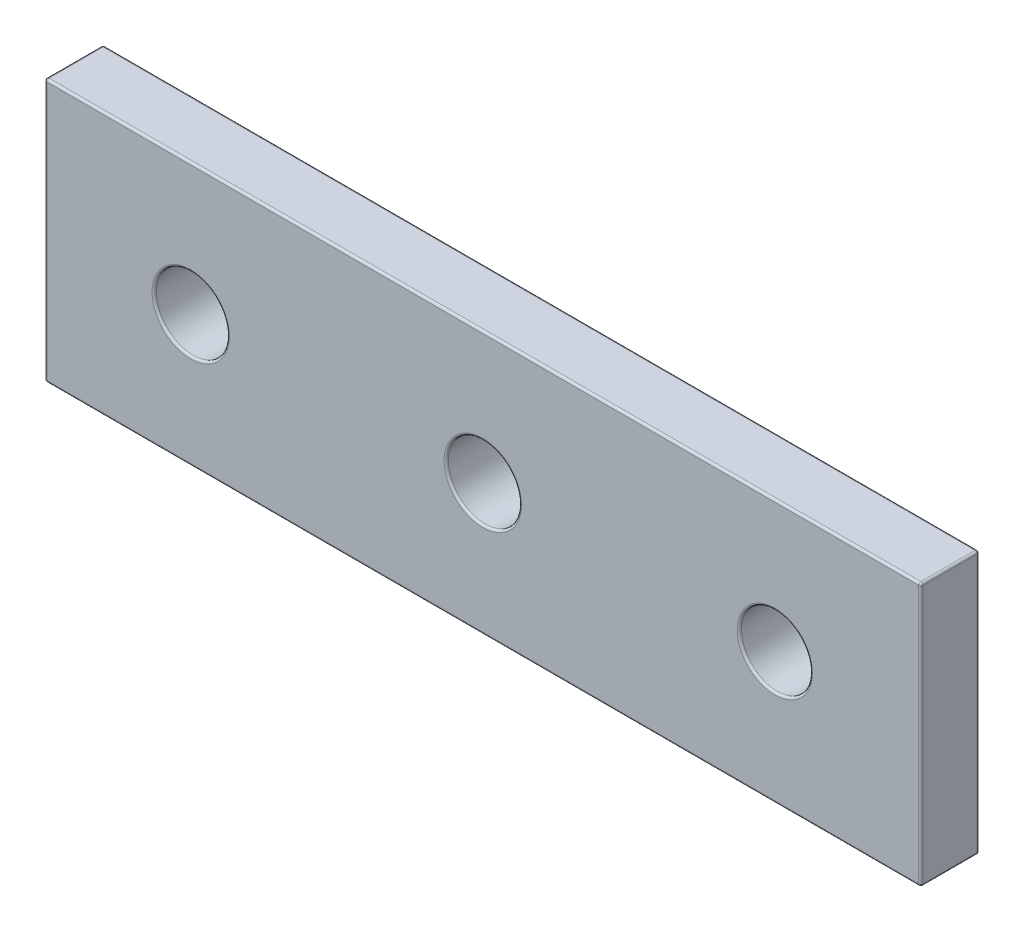
ISO-10303-21;
HEADER;
FILE_DESCRIPTION(('STEP AP214'),'2;1');
FILE_NAME('part.step','',(''),(''),'','','');
FILE_SCHEMA(('AUTOMOTIVE_DESIGN { 1 0 10303 214 1 1 1 1 }'));
ENDSEC;
DATA;
#1=APPLICATION_CONTEXT('core data for automotive mechanical design processes');
#2=APPLICATION_PROTOCOL_DEFINITION('international standard','automotive_design',2000,#1);
#3=PRODUCT_CONTEXT('',#1,'mechanical');
#4=PRODUCT('Part','Part','',(#3));
#5=PRODUCT_RELATED_PRODUCT_CATEGORY('part','',(#4));
#6=PRODUCT_DEFINITION_FORMATION('','',#4);
#7=PRODUCT_DEFINITION_CONTEXT('part definition',#1,'design');
#8=PRODUCT_DEFINITION('design','',#6,#7);
#9=PRODUCT_DEFINITION_SHAPE('','',#8);
#10=(LENGTH_UNIT() NAMED_UNIT(*) SI_UNIT(.MILLI.,.METRE.));
#11=(NAMED_UNIT(*) PLANE_ANGLE_UNIT() SI_UNIT($,.RADIAN.));
#12=(NAMED_UNIT(*) SI_UNIT($,.STERADIAN.) SOLID_ANGLE_UNIT());
#13=UNCERTAINTY_MEASURE_WITH_UNIT(LENGTH_MEASURE(1.E-05),#10,'distance_accuracy_value','');
#14=(GEOMETRIC_REPRESENTATION_CONTEXT(3) GLOBAL_UNCERTAINTY_ASSIGNED_CONTEXT((#13)) GLOBAL_UNIT_ASSIGNED_CONTEXT((#10,
#11,#12)) REPRESENTATION_CONTEXT('',''));
#15=CARTESIAN_POINT('',(0.,0.,0.));
#16=DIRECTION('',(0.,0.,1.));
#17=DIRECTION('',(1.,0.,0.));
#18=AXIS2_PLACEMENT_3D('',#15,#16,#17);
#19=CARTESIAN_POINT('',(0.,0.,4.));
#20=DIRECTION('',(0.,0.,1.));
#21=DIRECTION('',(1.,0.,0.));
#22=AXIS2_PLACEMENT_3D('',#19,#20,#21);
#23=PLANE('',#22);
#24=CARTESIAN_POINT('',(20.,0.,4.));
#25=DIRECTION('',(0.,0.,1.));
#26=DIRECTION('',(1.,0.,0.));
#27=AXIS2_PLACEMENT_3D('',#24,#25,#26);
#28=CIRCLE('',#27,2.5758241682766);
#29=CARTESIAN_POINT('',(22.5758241682766,0.,4.));
#30=VERTEX_POINT('',#29);
#31=EDGE_CURVE('E12',#30,#30,#28,.F.);
#32=ORIENTED_EDGE('',*,*,#31,.T.);
#33=EDGE_LOOP('',(#32));
#34=FACE_BOUND('',#33,.T.);
#35=CARTESIAN_POINT('',(0.,0.,4.));
#36=DIRECTION('',(0.,0.,1.));
#37=DIRECTION('',(1.,0.,0.));
#38=AXIS2_PLACEMENT_3D('',#35,#36,#37);
#39=CIRCLE('',#38,2.65);
#40=CARTESIAN_POINT('',(2.65,0.,4.));
#41=VERTEX_POINT('',#40);
#42=EDGE_CURVE('E86',#41,#41,#39,.F.);
#43=ORIENTED_EDGE('',*,*,#42,.T.);
#44=EDGE_LOOP('',(#43));
#45=FACE_BOUND('',#44,.T.);
#46=DIRECTION('',(0.,-1.,0.));
#47=VECTOR('',#46,1.);
#48=CARTESIAN_POINT('',(29.85,0.,4.));
#49=LINE('',#48,#47);
#50=CARTESIAN_POINT('',(29.85,-8.85,4.));
#51=VERTEX_POINT('',#50);
#52=CARTESIAN_POINT('',(29.85,8.85,4.));
#53=VERTEX_POINT('',#52);
#54=EDGE_CURVE('E94',#51,#53,#49,.F.);
#55=ORIENTED_EDGE('',*,*,#54,.T.);
#56=DIRECTION('',(1.,0.,0.));
#57=VECTOR('',#56,1.);
#58=CARTESIAN_POINT('',(0.,8.85,4.));
#59=LINE('',#58,#57);
#60=CARTESIAN_POINT('',(-29.85,8.85,4.));
#61=VERTEX_POINT('',#60);
#62=EDGE_CURVE('E275',#53,#61,#59,.F.);
#63=ORIENTED_EDGE('',*,*,#62,.T.);
#64=DIRECTION('',(0.,-1.,0.));
#65=VECTOR('',#64,1.);
#66=CARTESIAN_POINT('',(-29.85,-9.,4.));
#67=LINE('',#66,#65);
#68=CARTESIAN_POINT('',(-29.85,-8.85,4.));
#69=VERTEX_POINT('',#68);
#70=EDGE_CURVE('E271',#61,#69,#67,.T.);
#71=ORIENTED_EDGE('',*,*,#70,.T.);
#72=DIRECTION('',(1.,0.,0.));
#73=VECTOR('',#72,1.);
#74=CARTESIAN_POINT('',(30.,-8.85,4.));
#75=LINE('',#74,#73);
#76=EDGE_CURVE('E99',#69,#51,#75,.T.);
#77=ORIENTED_EDGE('',*,*,#76,.T.);
#78=EDGE_LOOP('',(#55,#63,#71,#77));
#79=FACE_BOUND('',#78,.T.);
#80=CARTESIAN_POINT('',(-20.,0.,4.));
#81=DIRECTION('',(0.,0.,1.));
#82=DIRECTION('',(1.,0.,0.));
#83=AXIS2_PLACEMENT_3D('',#80,#81,#82);
#84=CIRCLE('',#83,2.65);
#85=CARTESIAN_POINT('',(-17.35,0.,4.));
#86=VERTEX_POINT('',#85);
#87=EDGE_CURVE('E268',#86,#86,#84,.F.);
#88=ORIENTED_EDGE('',*,*,#87,.T.);
#89=EDGE_LOOP('',(#88));
#90=FACE_BOUND('',#89,.T.);
#91=ADVANCED_FACE('F77',(#34,#45,#79,#90),#23,.T.);
#92=CARTESIAN_POINT('',(0.,0.,0.));
#93=DIRECTION('',(0.,0.,1.));
#94=DIRECTION('',(1.,0.,0.));
#95=AXIS2_PLACEMENT_3D('',#92,#93,#94);
#96=PLANE('',#95);
#97=CARTESIAN_POINT('',(20.,0.,0.));
#98=DIRECTION('',(0.,0.,1.));
#99=DIRECTION('',(1.,0.,0.));
#100=AXIS2_PLACEMENT_3D('',#97,#98,#99);
#101=CIRCLE('',#100,2.5758241682766);
#102=CARTESIAN_POINT('',(22.5758241682766,0.,0.));
#103=VERTEX_POINT('',#102);
#104=EDGE_CURVE('E209',#103,#103,#101,.T.);
#105=ORIENTED_EDGE('',*,*,#104,.T.);
#106=EDGE_LOOP('',(#105));
#107=FACE_BOUND('',#106,.T.);
#108=CARTESIAN_POINT('',(0.,0.,0.));
#109=DIRECTION('',(0.,0.,1.));
#110=DIRECTION('',(1.,0.,0.));
#111=AXIS2_PLACEMENT_3D('',#108,#109,#110);
#112=CIRCLE('',#111,2.65);
#113=CARTESIAN_POINT('',(2.65,0.,0.));
#114=VERTEX_POINT('',#113);
#115=EDGE_CURVE('E206',#114,#114,#112,.T.);
#116=ORIENTED_EDGE('',*,*,#115,.T.);
#117=EDGE_LOOP('',(#116));
#118=FACE_BOUND('',#117,.T.);
#119=DIRECTION('',(0.,-1.,0.));
#120=VECTOR('',#119,1.);
#121=CARTESIAN_POINT('',(29.85,-9.,0.));
#122=LINE('',#121,#120);
#123=CARTESIAN_POINT('',(29.85,8.85,0.));
#124=VERTEX_POINT('',#123);
#125=CARTESIAN_POINT('',(29.85,-8.85,0.));
#126=VERTEX_POINT('',#125);
#127=EDGE_CURVE('E204',#124,#126,#122,.T.);
#128=ORIENTED_EDGE('',*,*,#127,.T.);
#129=DIRECTION('',(1.,0.,0.));
#130=VECTOR('',#129,1.);
#131=CARTESIAN_POINT('',(0.,-8.85,0.));
#132=LINE('',#131,#130);
#133=CARTESIAN_POINT('',(-29.85,-8.85,0.));
#134=VERTEX_POINT('',#133);
#135=EDGE_CURVE('E172',#126,#134,#132,.F.);
#136=ORIENTED_EDGE('',*,*,#135,.T.);
#137=DIRECTION('',(0.,-1.,0.));
#138=VECTOR('',#137,1.);
#139=CARTESIAN_POINT('',(-29.85,0.,0.));
#140=LINE('',#139,#138);
#141=CARTESIAN_POINT('',(-29.85,8.85,0.));
#142=VERTEX_POINT('',#141);
#143=EDGE_CURVE('E192',#134,#142,#140,.F.);
#144=ORIENTED_EDGE('',*,*,#143,.T.);
#145=DIRECTION('',(1.,0.,0.));
#146=VECTOR('',#145,1.);
#147=CARTESIAN_POINT('',(30.,8.85,0.));
#148=LINE('',#147,#146);
#149=EDGE_CURVE('E198',#142,#124,#148,.T.);
#150=ORIENTED_EDGE('',*,*,#149,.T.);
#151=EDGE_LOOP('',(#128,#136,#144,#150));
#152=FACE_BOUND('',#151,.T.);
#153=CARTESIAN_POINT('',(-20.,0.,0.));
#154=DIRECTION('',(0.,0.,1.));
#155=DIRECTION('',(1.,0.,0.));
#156=AXIS2_PLACEMENT_3D('',#153,#154,#155);
#157=CIRCLE('',#156,2.65);
#158=CARTESIAN_POINT('',(-17.35,0.,0.));
#159=VERTEX_POINT('',#158);
#160=EDGE_CURVE('E199',#159,#159,#157,.T.);
#161=ORIENTED_EDGE('',*,*,#160,.T.);
#162=EDGE_LOOP('',(#161));
#163=FACE_BOUND('',#162,.T.);
#164=ADVANCED_FACE('F201',(#107,#118,#152,#163),#96,.F.);
#165=CARTESIAN_POINT('',(-30.,9.,4.));
#166=DIRECTION('',(1.,0.,0.));
#167=DIRECTION('',(0.,0.,-1.));
#168=AXIS2_PLACEMENT_3D('',#165,#166,#167);
#169=PLANE('',#168);
#170=DIRECTION('',(0.,-1.,0.));
#171=VECTOR('',#170,1.);
#172=CARTESIAN_POINT('',(-30.,9.,3.85));
#173=LINE('',#172,#171);
#174=CARTESIAN_POINT('',(-30.,-8.85,3.85));
#175=VERTEX_POINT('',#174);
#176=CARTESIAN_POINT('',(-30.,8.85,3.85));
#177=VERTEX_POINT('',#176);
#178=EDGE_CURVE('E255',#175,#177,#173,.F.);
#179=ORIENTED_EDGE('',*,*,#178,.T.);
#180=DIRECTION('',(0.,0.,-1.));
#181=VECTOR('',#180,1.);
#182=CARTESIAN_POINT('',(-30.,8.85,0.));
#183=LINE('',#182,#181);
#184=CARTESIAN_POINT('',(-30.,8.85,0.15));
#185=VERTEX_POINT('',#184);
#186=EDGE_CURVE('E260',#177,#185,#183,.T.);
#187=ORIENTED_EDGE('',*,*,#186,.T.);
#188=DIRECTION('',(0.,-1.,0.));
#189=VECTOR('',#188,1.);
#190=CARTESIAN_POINT('',(-30.,9.,0.15));
#191=LINE('',#190,#189);
#192=CARTESIAN_POINT('',(-30.,-8.85,0.15));
#193=VERTEX_POINT('',#192);
#194=EDGE_CURVE('E257',#185,#193,#191,.T.);
#195=ORIENTED_EDGE('',*,*,#194,.T.);
#196=DIRECTION('',(0.,0.,-1.));
#197=VECTOR('',#196,1.);
#198=CARTESIAN_POINT('',(-30.,-8.85,4.));
#199=LINE('',#198,#197);
#200=EDGE_CURVE('E253',#193,#175,#199,.F.);
#201=ORIENTED_EDGE('',*,*,#200,.T.);
#202=EDGE_LOOP('',(#179,#187,#195,#201));
#203=FACE_BOUND('',#202,.T.);
#204=ADVANCED_FACE('F373',(#203),#169,.F.);
#205=CARTESIAN_POINT('',(-30.,-9.,4.));
#206=DIRECTION('',(0.,1.,0.));
#207=DIRECTION('',(0.,0.,1.));
#208=AXIS2_PLACEMENT_3D('',#205,#206,#207);
#209=PLANE('',#208);
#210=DIRECTION('',(1.,0.,0.));
#211=VECTOR('',#210,1.);
#212=CARTESIAN_POINT('',(-30.,-9.,3.85));
#213=LINE('',#212,#211);
#214=CARTESIAN_POINT('',(29.85,-9.,3.85));
#215=VERTEX_POINT('',#214);
#216=CARTESIAN_POINT('',(-29.85,-9.,3.85));
#217=VERTEX_POINT('',#216);
#218=EDGE_CURVE('E230',#215,#217,#213,.F.);
#219=ORIENTED_EDGE('',*,*,#218,.T.);
#220=DIRECTION('',(0.,0.,-1.));
#221=VECTOR('',#220,1.);
#222=CARTESIAN_POINT('',(-29.85,-9.,4.));
#223=LINE('',#222,#221);
#224=CARTESIAN_POINT('',(-29.85,-9.,0.15));
#225=VERTEX_POINT('',#224);
#226=EDGE_CURVE('E233',#217,#225,#223,.T.);
#227=ORIENTED_EDGE('',*,*,#226,.T.);
#228=DIRECTION('',(1.,0.,0.));
#229=VECTOR('',#228,1.);
#230=CARTESIAN_POINT('',(-30.,-9.,0.15));
#231=LINE('',#230,#229);
#232=CARTESIAN_POINT('',(29.85,-9.,0.15));
#233=VERTEX_POINT('',#232);
#234=EDGE_CURVE('E175',#225,#233,#231,.T.);
#235=ORIENTED_EDGE('',*,*,#234,.T.);
#236=DIRECTION('',(0.,0.,-1.));
#237=VECTOR('',#236,1.);
#238=CARTESIAN_POINT('',(29.85,-9.,4.));
#239=LINE('',#238,#237);
#240=EDGE_CURVE('E228',#233,#215,#239,.F.);
#241=ORIENTED_EDGE('',*,*,#240,.T.);
#242=EDGE_LOOP('',(#219,#227,#235,#241));
#243=FACE_BOUND('',#242,.T.);
#244=ADVANCED_FACE('F365',(#243),#209,.F.);
#245=CARTESIAN_POINT('',(30.,9.,4.));
#246=DIRECTION('',(1.,0.,0.));
#247=DIRECTION('',(0.,0.,-1.));
#248=AXIS2_PLACEMENT_3D('',#245,#246,#247);
#249=PLANE('',#248);
#250=DIRECTION('',(0.,-1.,0.));
#251=VECTOR('',#250,1.);
#252=CARTESIAN_POINT('',(30.,9.,3.85));
#253=LINE('',#252,#251);
#254=CARTESIAN_POINT('',(30.,8.85,3.85));
#255=VERTEX_POINT('',#254);
#256=CARTESIAN_POINT('',(30.,-8.85,3.85));
#257=VERTEX_POINT('',#256);
#258=EDGE_CURVE('E237',#255,#257,#253,.T.);
#259=ORIENTED_EDGE('',*,*,#258,.T.);
#260=DIRECTION('',(0.,0.,-1.));
#261=VECTOR('',#260,1.);
#262=CARTESIAN_POINT('',(30.,-8.85,0.));
#263=LINE('',#262,#261);
#264=CARTESIAN_POINT('',(30.,-8.85,0.15));
#265=VERTEX_POINT('',#264);
#266=EDGE_CURVE('E242',#257,#265,#263,.T.);
#267=ORIENTED_EDGE('',*,*,#266,.T.);
#268=DIRECTION('',(0.,-1.,0.));
#269=VECTOR('',#268,1.);
#270=CARTESIAN_POINT('',(30.,9.,0.15));
#271=LINE('',#270,#269);
#272=CARTESIAN_POINT('',(30.,8.85,0.15));
#273=VERTEX_POINT('',#272);
#274=EDGE_CURVE('E239',#265,#273,#271,.F.);
#275=ORIENTED_EDGE('',*,*,#274,.T.);
#276=DIRECTION('',(0.,0.,-1.));
#277=VECTOR('',#276,1.);
#278=CARTESIAN_POINT('',(30.,8.85,4.));
#279=LINE('',#278,#277);
#280=EDGE_CURVE('E235',#273,#255,#279,.F.);
#281=ORIENTED_EDGE('',*,*,#280,.T.);
#282=EDGE_LOOP('',(#259,#267,#275,#281));
#283=FACE_BOUND('',#282,.T.);
#284=ADVANCED_FACE('F409',(#283),#249,.T.);
#285=CARTESIAN_POINT('',(-30.,9.,4.));
#286=DIRECTION('',(0.,1.,0.));
#287=DIRECTION('',(0.,0.,1.));
#288=AXIS2_PLACEMENT_3D('',#285,#286,#287);
#289=PLANE('',#288);
#290=DIRECTION('',(1.,0.,0.));
#291=VECTOR('',#290,1.);
#292=CARTESIAN_POINT('',(-30.,9.,0.15));
#293=LINE('',#292,#291);
#294=CARTESIAN_POINT('',(29.85,9.,0.15));
#295=VERTEX_POINT('',#294);
#296=CARTESIAN_POINT('',(-29.85,9.,0.15));
#297=VERTEX_POINT('',#296);
#298=EDGE_CURVE('E248',#295,#297,#293,.F.);
#299=ORIENTED_EDGE('',*,*,#298,.T.);
#300=DIRECTION('',(0.,0.,-1.));
#301=VECTOR('',#300,1.);
#302=CARTESIAN_POINT('',(-29.85,9.,4.));
#303=LINE('',#302,#301);
#304=CARTESIAN_POINT('',(-29.85,9.,3.85));
#305=VERTEX_POINT('',#304);
#306=EDGE_CURVE('E251',#297,#305,#303,.F.);
#307=ORIENTED_EDGE('',*,*,#306,.T.);
#308=DIRECTION('',(1.,0.,0.));
#309=VECTOR('',#308,1.);
#310=CARTESIAN_POINT('',(-30.,9.,3.85));
#311=LINE('',#310,#309);
#312=CARTESIAN_POINT('',(29.85,9.,3.85));
#313=VERTEX_POINT('',#312);
#314=EDGE_CURVE('E246',#305,#313,#311,.T.);
#315=ORIENTED_EDGE('',*,*,#314,.T.);
#316=DIRECTION('',(0.,0.,-1.));
#317=VECTOR('',#316,1.);
#318=CARTESIAN_POINT('',(29.85,9.,4.));
#319=LINE('',#318,#317);
#320=EDGE_CURVE('E244',#313,#295,#319,.T.);
#321=ORIENTED_EDGE('',*,*,#320,.T.);
#322=EDGE_LOOP('',(#299,#307,#315,#321));
#323=FACE_BOUND('',#322,.T.);
#324=ADVANCED_FACE('F406',(#323),#289,.T.);
#325=CARTESIAN_POINT('',(0.,0.,4.));
#326=DIRECTION('',(0.,0.,-1.));
#327=DIRECTION('',(-1.,0.,0.));
#328=AXIS2_PLACEMENT_3D('',#325,#326,#327);
#329=CYLINDRICAL_SURFACE('',#328,2.5);
#330=CARTESIAN_POINT('',(0.,0.,0.15));
#331=DIRECTION('',(0.,0.,1.));
#332=DIRECTION('',(1.,0.,0.));
#333=AXIS2_PLACEMENT_3D('',#330,#331,#332);
#334=CIRCLE('',#333,2.5);
#335=CARTESIAN_POINT('',(2.5,0.,0.15));
#336=VERTEX_POINT('',#335);
#337=EDGE_CURVE('E225',#336,#336,#334,.F.);
#338=ORIENTED_EDGE('',*,*,#337,.T.);
#339=EDGE_LOOP('',(#338));
#340=FACE_BOUND('',#339,.T.);
#341=CARTESIAN_POINT('',(0.,0.,3.85));
#342=DIRECTION('',(0.,0.,1.));
#343=DIRECTION('',(1.,0.,0.));
#344=AXIS2_PLACEMENT_3D('',#341,#342,#343);
#345=CIRCLE('',#344,2.5);
#346=CARTESIAN_POINT('',(2.5,0.,3.85));
#347=VERTEX_POINT('',#346);
#348=EDGE_CURVE('E222',#347,#347,#345,.T.);
#349=ORIENTED_EDGE('',*,*,#348,.T.);
#350=EDGE_LOOP('',(#349));
#351=FACE_BOUND('',#350,.T.);
#352=ADVANCED_FACE('F403',(#340,#351),#329,.F.);
#353=CARTESIAN_POINT('',(-20.,0.,4.));
#354=DIRECTION('',(0.,0.,-1.));
#355=DIRECTION('',(-1.,0.,0.));
#356=AXIS2_PLACEMENT_3D('',#353,#354,#355);
#357=CYLINDRICAL_SURFACE('',#356,2.5);
#358=CARTESIAN_POINT('',(-20.,0.,0.15));
#359=DIRECTION('',(0.,0.,1.));
#360=DIRECTION('',(1.,0.,0.));
#361=AXIS2_PLACEMENT_3D('',#358,#359,#360);
#362=CIRCLE('',#361,2.5);
#363=CARTESIAN_POINT('',(-17.5,0.,0.15));
#364=VERTEX_POINT('',#363);
#365=EDGE_CURVE('E265',#364,#364,#362,.F.);
#366=ORIENTED_EDGE('',*,*,#365,.T.);
#367=EDGE_LOOP('',(#366));
#368=FACE_BOUND('',#367,.T.);
#369=CARTESIAN_POINT('',(-20.,0.,3.85));
#370=DIRECTION('',(0.,0.,1.));
#371=DIRECTION('',(1.,0.,0.));
#372=AXIS2_PLACEMENT_3D('',#369,#370,#371);
#373=CIRCLE('',#372,2.5);
#374=CARTESIAN_POINT('',(-17.5,0.,3.85));
#375=VERTEX_POINT('',#374);
#376=EDGE_CURVE('E262',#375,#375,#373,.T.);
#377=ORIENTED_EDGE('',*,*,#376,.T.);
#378=EDGE_LOOP('',(#377));
#379=FACE_BOUND('',#378,.T.);
#380=ADVANCED_FACE('F490',(#368,#379),#357,.F.);
#381=CARTESIAN_POINT('',(20.,0.,4.));
#382=DIRECTION('',(0.,0.,-1.));
#383=DIRECTION('',(-1.,0.,0.));
#384=AXIS2_PLACEMENT_3D('',#381,#382,#383);
#385=CYLINDRICAL_SURFACE('',#384,2.4258241682766);
#386=CARTESIAN_POINT('',(20.,0.,0.15));
#387=DIRECTION('',(0.,0.,1.));
#388=DIRECTION('',(1.,0.,0.));
#389=AXIS2_PLACEMENT_3D('',#386,#387,#388);
#390=CIRCLE('',#389,2.4258241682766);
#391=CARTESIAN_POINT('',(22.4258241682766,0.,0.15));
#392=VERTEX_POINT('',#391);
#393=EDGE_CURVE('E219',#392,#392,#390,.F.);
#394=ORIENTED_EDGE('',*,*,#393,.T.);
#395=EDGE_LOOP('',(#394));
#396=FACE_BOUND('',#395,.T.);
#397=CARTESIAN_POINT('',(20.,0.,3.85));
#398=DIRECTION('',(0.,0.,1.));
#399=DIRECTION('',(1.,0.,0.));
#400=AXIS2_PLACEMENT_3D('',#397,#398,#399);
#401=CIRCLE('',#400,2.4258241682766);
#402=CARTESIAN_POINT('',(22.4258241682766,0.,3.85));
#403=VERTEX_POINT('',#402);
#404=EDGE_CURVE('E216',#403,#403,#401,.T.);
#405=ORIENTED_EDGE('',*,*,#404,.T.);
#406=EDGE_LOOP('',(#405));
#407=FACE_BOUND('',#406,.T.);
#408=ADVANCED_FACE('F422',(#396,#407),#385,.F.);
#409=CARTESIAN_POINT('',(20.,0.,0.15));
#410=DIRECTION('',(0.,0.,1.));
#411=DIRECTION('',(1.,0.,0.));
#412=AXIS2_PLACEMENT_3D('',#409,#410,#411);
#413=TOROIDAL_SURFACE('',#412,2.5758241682766,0.15);
#414=ORIENTED_EDGE('',*,*,#393,.F.);
#415=EDGE_LOOP('',(#414));
#416=FACE_BOUND('',#415,.T.);
#417=ORIENTED_EDGE('',*,*,#104,.F.);
#418=EDGE_LOOP('',(#417));
#419=FACE_BOUND('',#418,.T.);
#420=ADVANCED_FACE('F418',(#416,#419),#413,.T.);
#421=CARTESIAN_POINT('',(0.,0.,0.15));
#422=DIRECTION('',(0.,0.,1.));
#423=DIRECTION('',(1.,0.,0.));
#424=AXIS2_PLACEMENT_3D('',#421,#422,#423);
#425=TOROIDAL_SURFACE('',#424,2.65,0.15);
#426=ORIENTED_EDGE('',*,*,#337,.F.);
#427=EDGE_LOOP('',(#426));
#428=FACE_BOUND('',#427,.T.);
#429=ORIENTED_EDGE('',*,*,#115,.F.);
#430=EDGE_LOOP('',(#429));
#431=FACE_BOUND('',#430,.T.);
#432=ADVANCED_FACE('F421',(#428,#431),#425,.T.);
#433=CARTESIAN_POINT('',(-30.,8.85,3.85));
#434=DIRECTION('',(1.,0.,0.));
#435=DIRECTION('',(0.,0.,-1.));
#436=AXIS2_PLACEMENT_3D('',#433,#434,#435);
#437=CYLINDRICAL_SURFACE('',#436,0.15);
#438=CARTESIAN_POINT('',(-29.85,8.85,3.85));
#439=DIRECTION('',(-1.,0.,0.));
#440=DIRECTION('',(0.,0.,1.));
#441=AXIS2_PLACEMENT_3D('',#438,#439,#440);
#442=CIRCLE('',#441,0.15);
#443=EDGE_CURVE('E81',#61,#305,#442,.T.);
#444=ORIENTED_EDGE('',*,*,#443,.F.);
#445=ORIENTED_EDGE('',*,*,#62,.F.);
#446=CARTESIAN_POINT('',(29.85,8.85,3.85));
#447=DIRECTION('',(1.,0.,0.));
#448=DIRECTION('',(0.,0.,-1.));
#449=AXIS2_PLACEMENT_3D('',#446,#447,#448);
#450=CIRCLE('',#449,0.15);
#451=EDGE_CURVE('E328',#313,#53,#450,.T.);
#452=ORIENTED_EDGE('',*,*,#451,.F.);
#453=ORIENTED_EDGE('',*,*,#314,.F.);
#454=EDGE_LOOP('',(#444,#445,#452,#453));
#455=FACE_BOUND('',#454,.T.);
#456=ADVANCED_FACE('F426',(#455),#437,.T.);
#457=CARTESIAN_POINT('',(-29.85,8.85,3.85));
#458=DIRECTION('',(0.,0.,1.));
#459=DIRECTION('',(1.,0.,0.));
#460=AXIS2_PLACEMENT_3D('',#457,#458,#459);
#461=SPHERICAL_SURFACE('',#460,0.15);
#462=CARTESIAN_POINT('',(-29.85,8.85,3.85));
#463=DIRECTION('',(0.,1.,0.));
#464=DIRECTION('',(0.,0.,1.));
#465=AXIS2_PLACEMENT_3D('',#462,#463,#464);
#466=CIRCLE('',#465,0.15);
#467=EDGE_CURVE('E323',#61,#177,#466,.F.);
#468=ORIENTED_EDGE('',*,*,#467,.F.);
#469=ORIENTED_EDGE('',*,*,#443,.T.);
#470=CARTESIAN_POINT('',(-29.85,8.85,3.85));
#471=DIRECTION('',(0.,0.,1.));
#472=DIRECTION('',(1.,0.,0.));
#473=AXIS2_PLACEMENT_3D('',#470,#471,#472);
#474=CIRCLE('',#473,0.15);
#475=EDGE_CURVE('E326',#177,#305,#474,.F.);
#476=ORIENTED_EDGE('',*,*,#475,.F.);
#477=EDGE_LOOP('',(#468,#469,#476));
#478=FACE_BOUND('',#477,.T.);
#479=ADVANCED_FACE('F459',(#478),#461,.T.);
#480=CARTESIAN_POINT('',(29.85,8.85,3.85));
#481=DIRECTION('',(0.,0.,1.));
#482=DIRECTION('',(1.,0.,0.));
#483=AXIS2_PLACEMENT_3D('',#480,#481,#482);
#484=SPHERICAL_SURFACE('',#483,0.15);
#485=CARTESIAN_POINT('',(29.85,8.85,3.85));
#486=DIRECTION('',(0.,0.,1.));
#487=DIRECTION('',(1.,0.,0.));
#488=AXIS2_PLACEMENT_3D('',#485,#486,#487);
#489=CIRCLE('',#488,0.15);
#490=EDGE_CURVE('E317',#313,#255,#489,.F.);
#491=ORIENTED_EDGE('',*,*,#490,.F.);
#492=ORIENTED_EDGE('',*,*,#451,.T.);
#493=CARTESIAN_POINT('',(29.85,8.85,3.85));
#494=DIRECTION('',(0.,1.,0.));
#495=DIRECTION('',(0.,0.,1.));
#496=AXIS2_PLACEMENT_3D('',#493,#494,#495);
#497=CIRCLE('',#496,0.15);
#498=EDGE_CURVE('E320',#255,#53,#497,.F.);
#499=ORIENTED_EDGE('',*,*,#498,.F.);
#500=EDGE_LOOP('',(#491,#492,#499));
#501=FACE_BOUND('',#500,.T.);
#502=ADVANCED_FACE('F461',(#501),#484,.T.);
#503=CARTESIAN_POINT('',(-29.85,8.85,4.));
#504=DIRECTION('',(0.,0.,1.));
#505=DIRECTION('',(1.,0.,0.));
#506=AXIS2_PLACEMENT_3D('',#503,#504,#505);
#507=CYLINDRICAL_SURFACE('',#506,0.15);
#508=ORIENTED_EDGE('',*,*,#475,.T.);
#509=ORIENTED_EDGE('',*,*,#306,.F.);
#510=CARTESIAN_POINT('',(-29.85,8.85,0.15));
#511=DIRECTION('',(0.,0.,-1.));
#512=DIRECTION('',(0.,1.,0.));
#513=AXIS2_PLACEMENT_3D('',#510,#511,#512);
#514=CIRCLE('',#513,0.15);
#515=EDGE_CURVE('E312',#185,#297,#514,.T.);
#516=ORIENTED_EDGE('',*,*,#515,.F.);
#517=ORIENTED_EDGE('',*,*,#186,.F.);
#518=EDGE_LOOP('',(#508,#509,#516,#517));
#519=FACE_BOUND('',#518,.T.);
#520=ADVANCED_FACE('F378',(#519),#507,.T.);
#521=CARTESIAN_POINT('',(-29.85,0.,3.85));
#522=DIRECTION('',(0.,1.,0.));
#523=DIRECTION('',(0.,0.,1.));
#524=AXIS2_PLACEMENT_3D('',#521,#522,#523);
#525=CYLINDRICAL_SURFACE('',#524,0.15);
#526=ORIENTED_EDGE('',*,*,#467,.T.);
#527=ORIENTED_EDGE('',*,*,#178,.F.);
#528=CARTESIAN_POINT('',(-29.85,-8.85,3.85));
#529=DIRECTION('',(0.,-1.,0.));
#530=DIRECTION('',(0.,0.,-1.));
#531=AXIS2_PLACEMENT_3D('',#528,#529,#530);
#532=CIRCLE('',#531,0.15);
#533=EDGE_CURVE('E309',#69,#175,#532,.T.);
#534=ORIENTED_EDGE('',*,*,#533,.F.);
#535=ORIENTED_EDGE('',*,*,#70,.F.);
#536=EDGE_LOOP('',(#526,#527,#534,#535));
#537=FACE_BOUND('',#536,.T.);
#538=ADVANCED_FACE('F458',(#537),#525,.T.);
#539=CARTESIAN_POINT('',(0.,-8.85,3.85));
#540=DIRECTION('',(-1.,0.,0.));
#541=DIRECTION('',(0.,0.,1.));
#542=AXIS2_PLACEMENT_3D('',#539,#540,#541);
#543=CYLINDRICAL_SURFACE('',#542,0.15);
#544=CARTESIAN_POINT('',(29.85,-8.85,3.85));
#545=DIRECTION('',(1.,0.,0.));
#546=DIRECTION('',(0.,0.,-1.));
#547=AXIS2_PLACEMENT_3D('',#544,#545,#546);
#548=CIRCLE('',#547,0.15);
#549=EDGE_CURVE('E303',#51,#215,#548,.T.);
#550=ORIENTED_EDGE('',*,*,#549,.F.);
#551=ORIENTED_EDGE('',*,*,#76,.F.);
#552=CARTESIAN_POINT('',(-29.85,-8.85,3.85));
#553=DIRECTION('',(-1.,0.,0.));
#554=DIRECTION('',(0.,0.,1.));
#555=AXIS2_PLACEMENT_3D('',#552,#553,#554);
#556=CIRCLE('',#555,0.15);
#557=EDGE_CURVE('E306',#217,#69,#556,.T.);
#558=ORIENTED_EDGE('',*,*,#557,.F.);
#559=ORIENTED_EDGE('',*,*,#218,.F.);
#560=EDGE_LOOP('',(#550,#551,#558,#559));
#561=FACE_BOUND('',#560,.T.);
#562=ADVANCED_FACE('F455',(#561),#543,.T.);
#563=CARTESIAN_POINT('',(29.85,9.,3.85));
#564=DIRECTION('',(0.,-1.,0.));
#565=DIRECTION('',(0.,0.,-1.));
#566=AXIS2_PLACEMENT_3D('',#563,#564,#565);
#567=CYLINDRICAL_SURFACE('',#566,0.15);
#568=ORIENTED_EDGE('',*,*,#498,.T.);
#569=ORIENTED_EDGE('',*,*,#54,.F.);
#570=CARTESIAN_POINT('',(29.85,-8.85,3.85));
#571=DIRECTION('',(0.,-1.,0.));
#572=DIRECTION('',(0.,0.,-1.));
#573=AXIS2_PLACEMENT_3D('',#570,#571,#572);
#574=CIRCLE('',#573,0.15);
#575=EDGE_CURVE('E300',#257,#51,#574,.T.);
#576=ORIENTED_EDGE('',*,*,#575,.F.);
#577=ORIENTED_EDGE('',*,*,#258,.F.);
#578=EDGE_LOOP('',(#568,#569,#576,#577));
#579=FACE_BOUND('',#578,.T.);
#580=ADVANCED_FACE('F453',(#579),#567,.T.);
#581=CARTESIAN_POINT('',(29.85,8.85,4.));
#582=DIRECTION('',(0.,0.,-1.));
#583=DIRECTION('',(-1.,0.,0.));
#584=AXIS2_PLACEMENT_3D('',#581,#582,#583);
#585=CYLINDRICAL_SURFACE('',#584,0.15);
#586=ORIENTED_EDGE('',*,*,#490,.T.);
#587=ORIENTED_EDGE('',*,*,#280,.F.);
#588=CARTESIAN_POINT('',(29.85,8.85,0.15));
#589=DIRECTION('',(0.,0.,-1.));
#590=DIRECTION('',(-1.,0.,0.));
#591=AXIS2_PLACEMENT_3D('',#588,#589,#590);
#592=CIRCLE('',#591,0.15);
#593=EDGE_CURVE('E297',#295,#273,#592,.T.);
#594=ORIENTED_EDGE('',*,*,#593,.F.);
#595=ORIENTED_EDGE('',*,*,#320,.F.);
#596=EDGE_LOOP('',(#586,#587,#594,#595));
#597=FACE_BOUND('',#596,.T.);
#598=ADVANCED_FACE('F391',(#597),#585,.T.);
#599=CARTESIAN_POINT('',(0.,8.85,0.15));
#600=DIRECTION('',(-1.,0.,0.));
#601=DIRECTION('',(0.,0.,1.));
#602=AXIS2_PLACEMENT_3D('',#599,#600,#601);
#603=CYLINDRICAL_SURFACE('',#602,0.15);
#604=CARTESIAN_POINT('',(-29.85,8.85,0.15));
#605=DIRECTION('',(-1.,0.,0.));
#606=DIRECTION('',(0.,0.,1.));
#607=AXIS2_PLACEMENT_3D('',#604,#605,#606);
#608=CIRCLE('',#607,0.15);
#609=EDGE_CURVE('E314',#297,#142,#608,.T.);
#610=ORIENTED_EDGE('',*,*,#609,.F.);
#611=ORIENTED_EDGE('',*,*,#298,.F.);
#612=CARTESIAN_POINT('',(29.85,8.85,0.15));
#613=DIRECTION('',(1.,0.,0.));
#614=DIRECTION('',(0.,1.,0.));
#615=AXIS2_PLACEMENT_3D('',#612,#613,#614);
#616=CIRCLE('',#615,0.15);
#617=EDGE_CURVE('E294',#124,#295,#616,.T.);
#618=ORIENTED_EDGE('',*,*,#617,.F.);
#619=ORIENTED_EDGE('',*,*,#149,.F.);
#620=EDGE_LOOP('',(#610,#611,#618,#619));
#621=FACE_BOUND('',#620,.T.);
#622=ADVANCED_FACE('F347',(#621),#603,.T.);
#623=CARTESIAN_POINT('',(-29.85,8.85,0.15));
#624=DIRECTION('',(0.,0.,1.));
#625=DIRECTION('',(1.,0.,0.));
#626=AXIS2_PLACEMENT_3D('',#623,#624,#625);
#627=SPHERICAL_SURFACE('',#626,0.15);
#628=ORIENTED_EDGE('',*,*,#515,.T.);
#629=ORIENTED_EDGE('',*,*,#609,.T.);
#630=CARTESIAN_POINT('',(-29.85,8.85,0.15));
#631=DIRECTION('',(0.,1.,0.));
#632=DIRECTION('',(0.,0.,1.));
#633=AXIS2_PLACEMENT_3D('',#630,#631,#632);
#634=CIRCLE('',#633,0.15);
#635=EDGE_CURVE('E195',#185,#142,#634,.F.);
#636=ORIENTED_EDGE('',*,*,#635,.F.);
#637=EDGE_LOOP('',(#628,#629,#636));
#638=FACE_BOUND('',#637,.T.);
#639=ADVANCED_FACE('F380',(#638),#627,.T.);
#640=CARTESIAN_POINT('',(-29.85,-8.85,3.85));
#641=DIRECTION('',(0.,0.,1.));
#642=DIRECTION('',(1.,0.,0.));
#643=AXIS2_PLACEMENT_3D('',#640,#641,#642);
#644=SPHERICAL_SURFACE('',#643,0.15);
#645=ORIENTED_EDGE('',*,*,#557,.T.);
#646=ORIENTED_EDGE('',*,*,#533,.T.);
#647=CARTESIAN_POINT('',(-29.85,-8.85,3.85));
#648=DIRECTION('',(0.,0.,1.));
#649=DIRECTION('',(1.,0.,0.));
#650=AXIS2_PLACEMENT_3D('',#647,#648,#649);
#651=CIRCLE('',#650,0.15);
#652=EDGE_CURVE('E290',#217,#175,#651,.F.);
#653=ORIENTED_EDGE('',*,*,#652,.F.);
#654=EDGE_LOOP('',(#645,#646,#653));
#655=FACE_BOUND('',#654,.T.);
#656=ADVANCED_FACE('F382',(#655),#644,.T.);
#657=CARTESIAN_POINT('',(29.85,-8.85,3.85));
#658=DIRECTION('',(0.,0.,1.));
#659=DIRECTION('',(1.,0.,0.));
#660=AXIS2_PLACEMENT_3D('',#657,#658,#659);
#661=SPHERICAL_SURFACE('',#660,0.15);
#662=ORIENTED_EDGE('',*,*,#575,.T.);
#663=ORIENTED_EDGE('',*,*,#549,.T.);
#664=CARTESIAN_POINT('',(29.85,-8.85,3.85));
#665=DIRECTION('',(0.,0.,1.));
#666=DIRECTION('',(1.,0.,0.));
#667=AXIS2_PLACEMENT_3D('',#664,#665,#666);
#668=CIRCLE('',#667,0.15);
#669=EDGE_CURVE('E287',#257,#215,#668,.F.);
#670=ORIENTED_EDGE('',*,*,#669,.F.);
#671=EDGE_LOOP('',(#662,#663,#670));
#672=FACE_BOUND('',#671,.T.);
#673=ADVANCED_FACE('F388',(#672),#661,.T.);
#674=CARTESIAN_POINT('',(29.85,8.85,0.15));
#675=DIRECTION('',(0.,0.,1.));
#676=DIRECTION('',(1.,0.,0.));
#677=AXIS2_PLACEMENT_3D('',#674,#675,#676);
#678=SPHERICAL_SURFACE('',#677,0.15);
#679=ORIENTED_EDGE('',*,*,#617,.T.);
#680=ORIENTED_EDGE('',*,*,#593,.T.);
#681=CARTESIAN_POINT('',(29.85,8.85,0.15));
#682=DIRECTION('',(0.,1.,0.));
#683=DIRECTION('',(0.,0.,1.));
#684=AXIS2_PLACEMENT_3D('',#681,#682,#683);
#685=CIRCLE('',#684,0.15);
#686=EDGE_CURVE('E189',#124,#273,#685,.F.);
#687=ORIENTED_EDGE('',*,*,#686,.F.);
#688=EDGE_LOOP('',(#679,#680,#687));
#689=FACE_BOUND('',#688,.T.);
#690=ADVANCED_FACE('F350',(#689),#678,.T.);
#691=CARTESIAN_POINT('',(-29.85,9.,0.15));
#692=DIRECTION('',(0.,-1.,0.));
#693=DIRECTION('',(0.,0.,-1.));
#694=AXIS2_PLACEMENT_3D('',#691,#692,#693);
#695=CYLINDRICAL_SURFACE('',#694,0.15);
#696=ORIENTED_EDGE('',*,*,#635,.T.);
#697=ORIENTED_EDGE('',*,*,#143,.F.);
#698=CARTESIAN_POINT('',(-29.85,-8.85,0.15));
#699=DIRECTION('',(0.,-1.,0.));
#700=DIRECTION('',(0.,0.,-1.));
#701=AXIS2_PLACEMENT_3D('',#698,#699,#700);
#702=CIRCLE('',#701,0.15);
#703=EDGE_CURVE('E181',#193,#134,#702,.T.);
#704=ORIENTED_EDGE('',*,*,#703,.F.);
#705=ORIENTED_EDGE('',*,*,#194,.F.);
#706=EDGE_LOOP('',(#696,#697,#704,#705));
#707=FACE_BOUND('',#706,.T.);
#708=ADVANCED_FACE('F193',(#707),#695,.T.);
#709=CARTESIAN_POINT('',(-29.85,-8.85,4.));
#710=DIRECTION('',(0.,0.,-1.));
#711=DIRECTION('',(-1.,0.,0.));
#712=AXIS2_PLACEMENT_3D('',#709,#710,#711);
#713=CYLINDRICAL_SURFACE('',#712,0.15);
#714=ORIENTED_EDGE('',*,*,#652,.T.);
#715=ORIENTED_EDGE('',*,*,#200,.F.);
#716=CARTESIAN_POINT('',(-29.85,-8.85,0.15));
#717=DIRECTION('',(0.,0.,-1.));
#718=DIRECTION('',(-1.,0.,0.));
#719=AXIS2_PLACEMENT_3D('',#716,#717,#718);
#720=CIRCLE('',#719,0.15);
#721=EDGE_CURVE('E185',#225,#193,#720,.T.);
#722=ORIENTED_EDGE('',*,*,#721,.F.);
#723=ORIENTED_EDGE('',*,*,#226,.F.);
#724=EDGE_LOOP('',(#714,#715,#722,#723));
#725=FACE_BOUND('',#724,.T.);
#726=ADVANCED_FACE('F369',(#725),#713,.T.);
#727=CARTESIAN_POINT('',(29.85,-8.85,4.));
#728=DIRECTION('',(0.,0.,1.));
#729=DIRECTION('',(1.,0.,0.));
#730=AXIS2_PLACEMENT_3D('',#727,#728,#729);
#731=CYLINDRICAL_SURFACE('',#730,0.15);
#732=ORIENTED_EDGE('',*,*,#669,.T.);
#733=ORIENTED_EDGE('',*,*,#240,.F.);
#734=CARTESIAN_POINT('',(29.85,-8.85,0.15));
#735=DIRECTION('',(0.,0.,-1.));
#736=DIRECTION('',(0.,1.,0.));
#737=AXIS2_PLACEMENT_3D('',#734,#735,#736);
#738=CIRCLE('',#737,0.15);
#739=EDGE_CURVE('E282',#265,#233,#738,.T.);
#740=ORIENTED_EDGE('',*,*,#739,.F.);
#741=ORIENTED_EDGE('',*,*,#266,.F.);
#742=EDGE_LOOP('',(#732,#733,#740,#741));
#743=FACE_BOUND('',#742,.T.);
#744=ADVANCED_FACE('F361',(#743),#731,.T.);
#745=CARTESIAN_POINT('',(29.85,0.,0.15));
#746=DIRECTION('',(0.,1.,0.));
#747=DIRECTION('',(0.,0.,1.));
#748=AXIS2_PLACEMENT_3D('',#745,#746,#747);
#749=CYLINDRICAL_SURFACE('',#748,0.15);
#750=ORIENTED_EDGE('',*,*,#686,.T.);
#751=ORIENTED_EDGE('',*,*,#274,.F.);
#752=CARTESIAN_POINT('',(29.85,-8.85,0.15));
#753=DIRECTION('',(0.,-1.,0.));
#754=DIRECTION('',(0.,0.,-1.));
#755=AXIS2_PLACEMENT_3D('',#752,#753,#754);
#756=CIRCLE('',#755,0.15);
#757=EDGE_CURVE('E177',#126,#265,#756,.T.);
#758=ORIENTED_EDGE('',*,*,#757,.F.);
#759=ORIENTED_EDGE('',*,*,#127,.F.);
#760=EDGE_LOOP('',(#750,#751,#758,#759));
#761=FACE_BOUND('',#760,.T.);
#762=ADVANCED_FACE('F354',(#761),#749,.T.);
#763=CARTESIAN_POINT('',(-29.85,-8.85,0.15));
#764=DIRECTION('',(0.,0.,1.));
#765=DIRECTION('',(1.,0.,0.));
#766=AXIS2_PLACEMENT_3D('',#763,#764,#765);
#767=SPHERICAL_SURFACE('',#766,0.15);
#768=ORIENTED_EDGE('',*,*,#721,.T.);
#769=ORIENTED_EDGE('',*,*,#703,.T.);
#770=CARTESIAN_POINT('',(-29.85,-8.85,0.15));
#771=DIRECTION('',(-1.,0.,0.));
#772=DIRECTION('',(0.,0.,1.));
#773=AXIS2_PLACEMENT_3D('',#770,#771,#772);
#774=CIRCLE('',#773,0.15);
#775=EDGE_CURVE('E168',#225,#134,#774,.F.);
#776=ORIENTED_EDGE('',*,*,#775,.F.);
#777=EDGE_LOOP('',(#768,#769,#776));
#778=FACE_BOUND('',#777,.T.);
#779=ADVANCED_FACE('F183',(#778),#767,.T.);
#780=CARTESIAN_POINT('',(29.85,-8.85,0.15));
#781=DIRECTION('',(0.,0.,1.));
#782=DIRECTION('',(1.,0.,0.));
#783=AXIS2_PLACEMENT_3D('',#780,#781,#782);
#784=SPHERICAL_SURFACE('',#783,0.15);
#785=ORIENTED_EDGE('',*,*,#757,.T.);
#786=ORIENTED_EDGE('',*,*,#739,.T.);
#787=CARTESIAN_POINT('',(29.85,-8.85,0.15));
#788=DIRECTION('',(1.,0.,0.));
#789=DIRECTION('',(0.,0.,-1.));
#790=AXIS2_PLACEMENT_3D('',#787,#788,#789);
#791=CIRCLE('',#790,0.15);
#792=EDGE_CURVE('E178',#126,#233,#791,.F.);
#793=ORIENTED_EDGE('',*,*,#792,.F.);
#794=EDGE_LOOP('',(#785,#786,#793));
#795=FACE_BOUND('',#794,.T.);
#796=ADVANCED_FACE('F357',(#795),#784,.T.);
#797=CARTESIAN_POINT('',(-30.,-8.85,0.15));
#798=DIRECTION('',(1.,0.,0.));
#799=DIRECTION('',(0.,0.,-1.));
#800=AXIS2_PLACEMENT_3D('',#797,#798,#799);
#801=CYLINDRICAL_SURFACE('',#800,0.15);
#802=ORIENTED_EDGE('',*,*,#775,.T.);
#803=ORIENTED_EDGE('',*,*,#135,.F.);
#804=ORIENTED_EDGE('',*,*,#792,.T.);
#805=ORIENTED_EDGE('',*,*,#234,.F.);
#806=EDGE_LOOP('',(#802,#803,#804,#805));
#807=FACE_BOUND('',#806,.T.);
#808=ADVANCED_FACE('F170',(#807),#801,.T.);
#809=CARTESIAN_POINT('',(-20.,0.,0.15));
#810=DIRECTION('',(0.,0.,1.));
#811=DIRECTION('',(1.,0.,0.));
#812=AXIS2_PLACEMENT_3D('',#809,#810,#811);
#813=TOROIDAL_SURFACE('',#812,2.65,0.15);
#814=ORIENTED_EDGE('',*,*,#365,.F.);
#815=EDGE_LOOP('',(#814));
#816=FACE_BOUND('',#815,.T.);
#817=ORIENTED_EDGE('',*,*,#160,.F.);
#818=EDGE_LOOP('',(#817));
#819=FACE_BOUND('',#818,.T.);
#820=ADVANCED_FACE('F430',(#816,#819),#813,.T.);
#821=CARTESIAN_POINT('',(20.,0.,3.85));
#822=DIRECTION('',(0.,0.,1.));
#823=DIRECTION('',(1.,0.,0.));
#824=AXIS2_PLACEMENT_3D('',#821,#822,#823);
#825=TOROIDAL_SURFACE('',#824,2.5758241682766,0.15);
#826=ORIENTED_EDGE('',*,*,#31,.F.);
#827=EDGE_LOOP('',(#826));
#828=FACE_BOUND('',#827,.T.);
#829=ORIENTED_EDGE('',*,*,#404,.F.);
#830=EDGE_LOOP('',(#829));
#831=FACE_BOUND('',#830,.T.);
#832=ADVANCED_FACE('F474',(#828,#831),#825,.T.);
#833=CARTESIAN_POINT('',(0.,0.,3.85));
#834=DIRECTION('',(0.,0.,1.));
#835=DIRECTION('',(1.,0.,0.));
#836=AXIS2_PLACEMENT_3D('',#833,#834,#835);
#837=TOROIDAL_SURFACE('',#836,2.65,0.15);
#838=ORIENTED_EDGE('',*,*,#42,.F.);
#839=EDGE_LOOP('',(#838));
#840=FACE_BOUND('',#839,.T.);
#841=ORIENTED_EDGE('',*,*,#348,.F.);
#842=EDGE_LOOP('',(#841));
#843=FACE_BOUND('',#842,.T.);
#844=ADVANCED_FACE('F477',(#840,#843),#837,.T.);
#845=CARTESIAN_POINT('',(-20.,0.,3.85));
#846=DIRECTION('',(0.,0.,1.));
#847=DIRECTION('',(1.,0.,0.));
#848=AXIS2_PLACEMENT_3D('',#845,#846,#847);
#849=TOROIDAL_SURFACE('',#848,2.65,0.15);
#850=ORIENTED_EDGE('',*,*,#87,.F.);
#851=EDGE_LOOP('',(#850));
#852=FACE_BOUND('',#851,.T.);
#853=ORIENTED_EDGE('',*,*,#376,.F.);
#854=EDGE_LOOP('',(#853));
#855=FACE_BOUND('',#854,.T.);
#856=ADVANCED_FACE('F79',(#852,#855),#849,.T.);
#857=CLOSED_SHELL('',(#91,#164,#204,#244,#284,#324,#352,#380,#408,#420,#432,#456,#479,#502,#520,
#538,#562,#580,#598,#622,#639,#656,#673,#690,#708,#726,#744,#762,#779,#796,#808,#820,#832,#844,#856));
#858=MANIFOLD_SOLID_BREP('B2',#857);
#859=ADVANCED_BREP_SHAPE_REPRESENTATION('',(#18,#858),#14);
#860=SHAPE_DEFINITION_REPRESENTATION(#9,#859);
ENDSEC;
END-ISO-10303-21;
